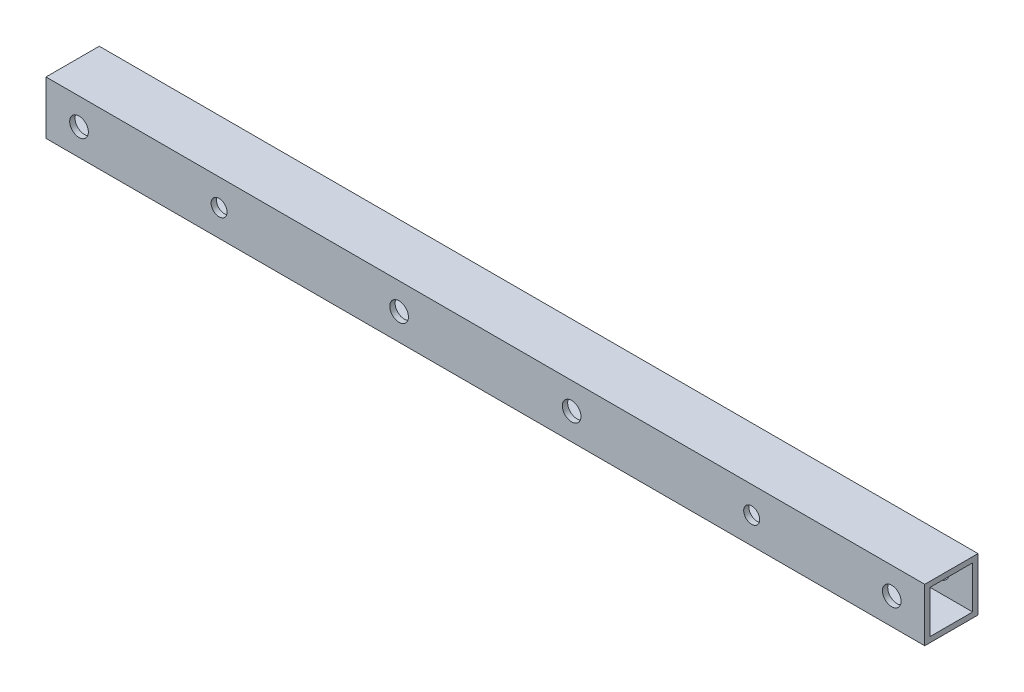
ISO-10303-21;
HEADER;
FILE_DESCRIPTION(('STEP AP214'),'2;1');
FILE_NAME('part.step','',(''),(''),'','','');
FILE_SCHEMA(('AUTOMOTIVE_DESIGN { 1 0 10303 214 1 1 1 1 }'));
ENDSEC;
DATA;
#1=APPLICATION_CONTEXT('core data for automotive mechanical design processes');
#2=APPLICATION_PROTOCOL_DEFINITION('international standard','automotive_design',2000,#1);
#3=PRODUCT_CONTEXT('',#1,'mechanical');
#4=PRODUCT('Part','Part','',(#3));
#5=PRODUCT_RELATED_PRODUCT_CATEGORY('part','',(#4));
#6=PRODUCT_DEFINITION_FORMATION('','',#4);
#7=PRODUCT_DEFINITION_CONTEXT('part definition',#1,'design');
#8=PRODUCT_DEFINITION('design','',#6,#7);
#9=PRODUCT_DEFINITION_SHAPE('','',#8);
#10=(LENGTH_UNIT() NAMED_UNIT(*) SI_UNIT(.MILLI.,.METRE.));
#11=(NAMED_UNIT(*) PLANE_ANGLE_UNIT() SI_UNIT($,.RADIAN.));
#12=(NAMED_UNIT(*) SI_UNIT($,.STERADIAN.) SOLID_ANGLE_UNIT());
#13=UNCERTAINTY_MEASURE_WITH_UNIT(LENGTH_MEASURE(1.E-05),#10,'distance_accuracy_value','');
#14=(GEOMETRIC_REPRESENTATION_CONTEXT(3) GLOBAL_UNCERTAINTY_ASSIGNED_CONTEXT((#13)) GLOBAL_UNIT_ASSIGNED_CONTEXT((#10,
#11,#12)) REPRESENTATION_CONTEXT('',''));
#15=CARTESIAN_POINT('',(0.,0.,0.));
#16=DIRECTION('',(0.,0.,1.));
#17=DIRECTION('',(1.,0.,0.));
#18=AXIS2_PLACEMENT_3D('',#15,#16,#17);
#19=CARTESIAN_POINT('',(-165.,-5.,-5.));
#20=DIRECTION('',(0.,0.,-1.));
#21=DIRECTION('',(-1.,0.,0.));
#22=AXIS2_PLACEMENT_3D('',#19,#20,#21);
#23=PLANE('',#22);
#24=CARTESIAN_POINT('',(-132.5,0.,-5.));
#25=DIRECTION('',(0.,0.,1.));
#26=DIRECTION('',(-1.,0.,0.));
#27=AXIS2_PLACEMENT_3D('',#24,#25,#26);
#28=CIRCLE('',#27,1.5);
#29=CARTESIAN_POINT('',(-134.,0.,-5.));
#30=VERTEX_POINT('',#29);
#31=EDGE_CURVE('E247',#30,#30,#28,.T.);
#32=ORIENTED_EDGE('',*,*,#31,.T.);
#33=EDGE_LOOP('',(#32));
#34=FACE_BOUND('',#33,.T.);
#35=CARTESIAN_POINT('',(-32.5,0.,-5.));
#36=DIRECTION('',(0.,0.,1.));
#37=DIRECTION('',(1.,0.,0.));
#38=AXIS2_PLACEMENT_3D('',#35,#36,#37);
#39=CIRCLE('',#38,1.5);
#40=CARTESIAN_POINT('',(-31.,0.,-5.));
#41=VERTEX_POINT('',#40);
#42=EDGE_CURVE('E254',#41,#41,#39,.T.);
#43=ORIENTED_EDGE('',*,*,#42,.T.);
#44=EDGE_LOOP('',(#43));
#45=FACE_BOUND('',#44,.T.);
#46=CARTESIAN_POINT('',(-158.8,0.,-5.));
#47=DIRECTION('',(0.,0.,1.));
#48=DIRECTION('',(-1.,0.,0.));
#49=AXIS2_PLACEMENT_3D('',#46,#47,#48);
#50=CIRCLE('',#49,1.75000000000001);
#51=CARTESIAN_POINT('',(-160.55,0.,-5.));
#52=VERTEX_POINT('',#51);
#53=EDGE_CURVE('E235',#52,#52,#50,.T.);
#54=ORIENTED_EDGE('',*,*,#53,.T.);
#55=EDGE_LOOP('',(#54));
#56=FACE_BOUND('',#55,.T.);
#57=CARTESIAN_POINT('',(-6.20000000000001,0.,-5.));
#58=DIRECTION('',(0.,0.,1.));
#59=DIRECTION('',(1.,0.,0.));
#60=AXIS2_PLACEMENT_3D('',#57,#58,#59);
#61=CIRCLE('',#60,1.75);
#62=CARTESIAN_POINT('',(-4.45000000000001,0.,-5.));
#63=VERTEX_POINT('',#62);
#64=EDGE_CURVE('E242',#63,#63,#61,.T.);
#65=ORIENTED_EDGE('',*,*,#64,.T.);
#66=EDGE_LOOP('',(#65));
#67=FACE_BOUND('',#66,.T.);
#68=CARTESIAN_POINT('',(-98.7,0.,-5.));
#69=DIRECTION('',(0.,0.,1.));
#70=DIRECTION('',(-1.,0.,0.));
#71=AXIS2_PLACEMENT_3D('',#68,#69,#70);
#72=CIRCLE('',#71,1.75);
#73=CARTESIAN_POINT('',(-100.45,0.,-5.));
#74=VERTEX_POINT('',#73);
#75=EDGE_CURVE('E259',#74,#74,#72,.T.);
#76=ORIENTED_EDGE('',*,*,#75,.T.);
#77=EDGE_LOOP('',(#76));
#78=FACE_BOUND('',#77,.T.);
#79=CARTESIAN_POINT('',(-66.3,0.,-5.));
#80=DIRECTION('',(0.,0.,1.));
#81=DIRECTION('',(1.,0.,0.));
#82=AXIS2_PLACEMENT_3D('',#79,#80,#81);
#83=CIRCLE('',#82,1.75);
#84=CARTESIAN_POINT('',(-64.55,0.,-5.));
#85=VERTEX_POINT('',#84);
#86=EDGE_CURVE('E200',#85,#85,#83,.T.);
#87=ORIENTED_EDGE('',*,*,#86,.T.);
#88=EDGE_LOOP('',(#87));
#89=FACE_BOUND('',#88,.T.);
#90=DIRECTION('',(0.,1.,0.));
#91=VECTOR('',#90,1.);
#92=CARTESIAN_POINT('',(0.,-5.,-5.));
#93=LINE('',#92,#91);
#94=CARTESIAN_POINT('',(0.,-5.,-5.));
#95=VERTEX_POINT('',#94);
#96=CARTESIAN_POINT('',(0.,5.,-5.));
#97=VERTEX_POINT('',#96);
#98=EDGE_CURVE('E164',#95,#97,#93,.T.);
#99=ORIENTED_EDGE('',*,*,#98,.F.);
#100=DIRECTION('',(1.,0.,0.));
#101=VECTOR('',#100,1.);
#102=CARTESIAN_POINT('',(-165.,-5.,-5.));
#103=LINE('',#102,#101);
#104=CARTESIAN_POINT('',(-165.,-5.,-5.));
#105=VERTEX_POINT('',#104);
#106=EDGE_CURVE('E12',#105,#95,#103,.T.);
#107=ORIENTED_EDGE('',*,*,#106,.F.);
#108=DIRECTION('',(0.,1.,0.));
#109=VECTOR('',#108,1.);
#110=CARTESIAN_POINT('',(-165.,-5.,-5.));
#111=LINE('',#110,#109);
#112=CARTESIAN_POINT('',(-165.,5.,-5.));
#113=VERTEX_POINT('',#112);
#114=EDGE_CURVE('E168',#105,#113,#111,.T.);
#115=ORIENTED_EDGE('',*,*,#114,.T.);
#116=DIRECTION('',(1.,0.,0.));
#117=VECTOR('',#116,1.);
#118=CARTESIAN_POINT('',(-165.,5.,-5.));
#119=LINE('',#118,#117);
#120=EDGE_CURVE('E181',#113,#97,#119,.T.);
#121=ORIENTED_EDGE('',*,*,#120,.T.);
#122=EDGE_LOOP('',(#99,#107,#115,#121));
#123=FACE_BOUND('',#122,.T.);
#124=ADVANCED_FACE('F63',(#34,#45,#56,#67,#78,#89,#123),#23,.T.);
#125=CARTESIAN_POINT('',(-165.,-5.,5.));
#126=DIRECTION('',(0.,-1.,0.));
#127=DIRECTION('',(0.,0.,-1.));
#128=AXIS2_PLACEMENT_3D('',#125,#126,#127);
#129=PLANE('',#128);
#130=DIRECTION('',(0.,0.,-1.));
#131=VECTOR('',#130,1.);
#132=CARTESIAN_POINT('',(0.,-5.,5.));
#133=LINE('',#132,#131);
#134=CARTESIAN_POINT('',(0.,-5.,5.));
#135=VERTEX_POINT('',#134);
#136=EDGE_CURVE('E172',#135,#95,#133,.T.);
#137=ORIENTED_EDGE('',*,*,#136,.F.);
#138=DIRECTION('',(1.,0.,0.));
#139=VECTOR('',#138,1.);
#140=CARTESIAN_POINT('',(-165.,-5.,5.));
#141=LINE('',#140,#139);
#142=CARTESIAN_POINT('',(-165.,-5.,5.));
#143=VERTEX_POINT('',#142);
#144=EDGE_CURVE('E71',#143,#135,#141,.T.);
#145=ORIENTED_EDGE('',*,*,#144,.F.);
#146=DIRECTION('',(0.,0.,-1.));
#147=VECTOR('',#146,1.);
#148=CARTESIAN_POINT('',(-165.,-5.,5.));
#149=LINE('',#148,#147);
#150=EDGE_CURVE('E178',#143,#105,#149,.T.);
#151=ORIENTED_EDGE('',*,*,#150,.T.);
#152=ORIENTED_EDGE('',*,*,#106,.T.);
#153=EDGE_LOOP('',(#137,#145,#151,#152));
#154=FACE_BOUND('',#153,.T.);
#155=ADVANCED_FACE('F272',(#154),#129,.T.);
#156=CARTESIAN_POINT('',(-165.,-5.,5.));
#157=DIRECTION('',(0.,0.,1.));
#158=DIRECTION('',(1.,0.,0.));
#159=AXIS2_PLACEMENT_3D('',#156,#157,#158);
#160=PLANE('',#159);
#161=CARTESIAN_POINT('',(-132.5,0.,5.));
#162=DIRECTION('',(0.,0.,1.));
#163=DIRECTION('',(-1.,0.,0.));
#164=AXIS2_PLACEMENT_3D('',#161,#162,#163);
#165=CIRCLE('',#164,1.5);
#166=CARTESIAN_POINT('',(-134.,0.,5.));
#167=VERTEX_POINT('',#166);
#168=EDGE_CURVE('E250',#167,#167,#165,.T.);
#169=ORIENTED_EDGE('',*,*,#168,.F.);
#170=EDGE_LOOP('',(#169));
#171=FACE_BOUND('',#170,.T.);
#172=CARTESIAN_POINT('',(-32.5,0.,5.));
#173=DIRECTION('',(0.,0.,1.));
#174=DIRECTION('',(1.,0.,0.));
#175=AXIS2_PLACEMENT_3D('',#172,#173,#174);
#176=CIRCLE('',#175,1.5);
#177=CARTESIAN_POINT('',(-31.,0.,5.));
#178=VERTEX_POINT('',#177);
#179=EDGE_CURVE('E239',#178,#178,#176,.T.);
#180=ORIENTED_EDGE('',*,*,#179,.F.);
#181=EDGE_LOOP('',(#180));
#182=FACE_BOUND('',#181,.T.);
#183=CARTESIAN_POINT('',(-158.8,0.,5.));
#184=DIRECTION('',(0.,0.,1.));
#185=DIRECTION('',(-1.,0.,0.));
#186=AXIS2_PLACEMENT_3D('',#183,#184,#185);
#187=CIRCLE('',#186,1.75000000000001);
#188=CARTESIAN_POINT('',(-160.55,0.,5.));
#189=VERTEX_POINT('',#188);
#190=EDGE_CURVE('E238',#189,#189,#187,.T.);
#191=ORIENTED_EDGE('',*,*,#190,.F.);
#192=EDGE_LOOP('',(#191));
#193=FACE_BOUND('',#192,.T.);
#194=CARTESIAN_POINT('',(-6.20000000000001,0.,5.));
#195=DIRECTION('',(0.,0.,1.));
#196=DIRECTION('',(1.,0.,0.));
#197=AXIS2_PLACEMENT_3D('',#194,#195,#196);
#198=CIRCLE('',#197,1.75);
#199=CARTESIAN_POINT('',(-4.45000000000001,0.,5.));
#200=VERTEX_POINT('',#199);
#201=EDGE_CURVE('E232',#200,#200,#198,.T.);
#202=ORIENTED_EDGE('',*,*,#201,.F.);
#203=EDGE_LOOP('',(#202));
#204=FACE_BOUND('',#203,.T.);
#205=CARTESIAN_POINT('',(-98.7,0.,5.));
#206=DIRECTION('',(0.,0.,1.));
#207=DIRECTION('',(-1.,0.,0.));
#208=AXIS2_PLACEMENT_3D('',#205,#206,#207);
#209=CIRCLE('',#208,1.75);
#210=CARTESIAN_POINT('',(-100.45,0.,5.));
#211=VERTEX_POINT('',#210);
#212=EDGE_CURVE('E251',#211,#211,#209,.T.);
#213=ORIENTED_EDGE('',*,*,#212,.F.);
#214=EDGE_LOOP('',(#213));
#215=FACE_BOUND('',#214,.T.);
#216=CARTESIAN_POINT('',(-66.3,0.,5.));
#217=DIRECTION('',(0.,0.,1.));
#218=DIRECTION('',(1.,0.,0.));
#219=AXIS2_PLACEMENT_3D('',#216,#217,#218);
#220=CIRCLE('',#219,1.75);
#221=CARTESIAN_POINT('',(-64.55,0.,5.));
#222=VERTEX_POINT('',#221);
#223=EDGE_CURVE('E229',#222,#222,#220,.T.);
#224=ORIENTED_EDGE('',*,*,#223,.F.);
#225=EDGE_LOOP('',(#224));
#226=FACE_BOUND('',#225,.T.);
#227=DIRECTION('',(0.,-1.,0.));
#228=VECTOR('',#227,1.);
#229=CARTESIAN_POINT('',(0.,-5.,5.));
#230=LINE('',#229,#228);
#231=CARTESIAN_POINT('',(0.,5.,5.));
#232=VERTEX_POINT('',#231);
#233=EDGE_CURVE('E187',#232,#135,#230,.T.);
#234=ORIENTED_EDGE('',*,*,#233,.F.);
#235=DIRECTION('',(1.,0.,0.));
#236=VECTOR('',#235,1.);
#237=CARTESIAN_POINT('',(-165.,5.,5.));
#238=LINE('',#237,#236);
#239=CARTESIAN_POINT('',(-165.,5.,5.));
#240=VERTEX_POINT('',#239);
#241=EDGE_CURVE('E193',#240,#232,#238,.T.);
#242=ORIENTED_EDGE('',*,*,#241,.F.);
#243=DIRECTION('',(0.,-1.,0.));
#244=VECTOR('',#243,1.);
#245=CARTESIAN_POINT('',(-165.,-5.,5.));
#246=LINE('',#245,#244);
#247=EDGE_CURVE('E175',#240,#143,#246,.T.);
#248=ORIENTED_EDGE('',*,*,#247,.T.);
#249=ORIENTED_EDGE('',*,*,#144,.T.);
#250=EDGE_LOOP('',(#234,#242,#248,#249));
#251=FACE_BOUND('',#250,.T.);
#252=ADVANCED_FACE('F268',(#171,#182,#193,#204,#215,#226,#251),#160,.T.);
#253=CARTESIAN_POINT('',(-165.,5.,5.));
#254=DIRECTION('',(0.,1.,0.));
#255=DIRECTION('',(0.,0.,1.));
#256=AXIS2_PLACEMENT_3D('',#253,#254,#255);
#257=PLANE('',#256);
#258=DIRECTION('',(0.,0.,1.));
#259=VECTOR('',#258,1.);
#260=CARTESIAN_POINT('',(0.,5.,5.));
#261=LINE('',#260,#259);
#262=EDGE_CURVE('E184',#97,#232,#261,.T.);
#263=ORIENTED_EDGE('',*,*,#262,.F.);
#264=ORIENTED_EDGE('',*,*,#120,.F.);
#265=DIRECTION('',(0.,0.,1.));
#266=VECTOR('',#265,1.);
#267=CARTESIAN_POINT('',(-165.,5.,5.));
#268=LINE('',#267,#266);
#269=EDGE_CURVE('E171',#113,#240,#268,.T.);
#270=ORIENTED_EDGE('',*,*,#269,.T.);
#271=ORIENTED_EDGE('',*,*,#241,.T.);
#272=EDGE_LOOP('',(#263,#264,#270,#271));
#273=FACE_BOUND('',#272,.T.);
#274=ADVANCED_FACE('F271',(#273),#257,.T.);
#275=CARTESIAN_POINT('',(-165.,0.,0.));
#276=DIRECTION('',(1.,0.,0.));
#277=DIRECTION('',(0.,0.,-1.));
#278=AXIS2_PLACEMENT_3D('',#275,#276,#277);
#279=PLANE('',#278);
#280=DIRECTION('',(0.,0.,-1.));
#281=VECTOR('',#280,1.);
#282=CARTESIAN_POINT('',(-165.,-4.,0.));
#283=LINE('',#282,#281);
#284=CARTESIAN_POINT('',(-165.,-4.,4.));
#285=VERTEX_POINT('',#284);
#286=CARTESIAN_POINT('',(-165.,-4.,-4.));
#287=VERTEX_POINT('',#286);
#288=EDGE_CURVE('E136',#285,#287,#283,.T.);
#289=ORIENTED_EDGE('',*,*,#288,.T.);
#290=DIRECTION('',(0.,1.,0.));
#291=VECTOR('',#290,1.);
#292=CARTESIAN_POINT('',(-165.,0.,-4.));
#293=LINE('',#292,#291);
#294=CARTESIAN_POINT('',(-165.,4.,-4.));
#295=VERTEX_POINT('',#294);
#296=EDGE_CURVE('E130',#287,#295,#293,.T.);
#297=ORIENTED_EDGE('',*,*,#296,.T.);
#298=DIRECTION('',(0.,0.,1.));
#299=VECTOR('',#298,1.);
#300=CARTESIAN_POINT('',(-165.,4.,0.));
#301=LINE('',#300,#299);
#302=CARTESIAN_POINT('',(-165.,4.,4.));
#303=VERTEX_POINT('',#302);
#304=EDGE_CURVE('E139',#295,#303,#301,.T.);
#305=ORIENTED_EDGE('',*,*,#304,.T.);
#306=DIRECTION('',(0.,-1.,0.));
#307=VECTOR('',#306,1.);
#308=CARTESIAN_POINT('',(-165.,0.,4.));
#309=LINE('',#308,#307);
#310=EDGE_CURVE('E79',#303,#285,#309,.T.);
#311=ORIENTED_EDGE('',*,*,#310,.T.);
#312=EDGE_LOOP('',(#289,#297,#305,#311));
#313=FACE_BOUND('',#312,.T.);
#314=ORIENTED_EDGE('',*,*,#114,.F.);
#315=ORIENTED_EDGE('',*,*,#150,.F.);
#316=ORIENTED_EDGE('',*,*,#247,.F.);
#317=ORIENTED_EDGE('',*,*,#269,.F.);
#318=EDGE_LOOP('',(#314,#315,#316,#317));
#319=FACE_BOUND('',#318,.T.);
#320=ADVANCED_FACE('F143',(#313,#319),#279,.F.);
#321=CARTESIAN_POINT('',(0.,0.,0.));
#322=DIRECTION('',(1.,0.,0.));
#323=DIRECTION('',(0.,0.,-1.));
#324=AXIS2_PLACEMENT_3D('',#321,#322,#323);
#325=PLANE('',#324);
#326=DIRECTION('',(0.,1.,0.));
#327=VECTOR('',#326,1.);
#328=CARTESIAN_POINT('',(0.,0.,-4.));
#329=LINE('',#328,#327);
#330=CARTESIAN_POINT('',(0.,-4.,-4.));
#331=VERTEX_POINT('',#330);
#332=CARTESIAN_POINT('',(0.,4.,-4.));
#333=VERTEX_POINT('',#332);
#334=EDGE_CURVE('E87',#331,#333,#329,.T.);
#335=ORIENTED_EDGE('',*,*,#334,.F.);
#336=DIRECTION('',(0.,0.,-1.));
#337=VECTOR('',#336,1.);
#338=CARTESIAN_POINT('',(0.,-4.,0.));
#339=LINE('',#338,#337);
#340=CARTESIAN_POINT('',(0.,-4.,4.));
#341=VERTEX_POINT('',#340);
#342=EDGE_CURVE('E146',#341,#331,#339,.T.);
#343=ORIENTED_EDGE('',*,*,#342,.F.);
#344=DIRECTION('',(0.,-1.,0.));
#345=VECTOR('',#344,1.);
#346=CARTESIAN_POINT('',(0.,0.,4.));
#347=LINE('',#346,#345);
#348=CARTESIAN_POINT('',(0.,4.,4.));
#349=VERTEX_POINT('',#348);
#350=EDGE_CURVE('E149',#349,#341,#347,.T.);
#351=ORIENTED_EDGE('',*,*,#350,.F.);
#352=DIRECTION('',(0.,0.,1.));
#353=VECTOR('',#352,1.);
#354=CARTESIAN_POINT('',(0.,4.,0.));
#355=LINE('',#354,#353);
#356=EDGE_CURVE('E158',#333,#349,#355,.T.);
#357=ORIENTED_EDGE('',*,*,#356,.F.);
#358=EDGE_LOOP('',(#335,#343,#351,#357));
#359=FACE_BOUND('',#358,.T.);
#360=ORIENTED_EDGE('',*,*,#98,.T.);
#361=ORIENTED_EDGE('',*,*,#262,.T.);
#362=ORIENTED_EDGE('',*,*,#233,.T.);
#363=ORIENTED_EDGE('',*,*,#136,.T.);
#364=EDGE_LOOP('',(#360,#361,#362,#363));
#365=FACE_BOUND('',#364,.T.);
#366=ADVANCED_FACE('F282',(#359,#365),#325,.T.);
#367=CARTESIAN_POINT('',(-165.,0.,-4.));
#368=DIRECTION('',(0.,0.,-1.));
#369=DIRECTION('',(-1.,0.,0.));
#370=AXIS2_PLACEMENT_3D('',#367,#368,#369);
#371=PLANE('',#370);
#372=CARTESIAN_POINT('',(-132.5,0.,-4.));
#373=DIRECTION('',(0.,0.,-1.));
#374=DIRECTION('',(-1.,0.,0.));
#375=AXIS2_PLACEMENT_3D('',#372,#373,#374);
#376=CIRCLE('',#375,1.5);
#377=CARTESIAN_POINT('',(-134.,0.,-4.));
#378=VERTEX_POINT('',#377);
#379=EDGE_CURVE('E152',#378,#378,#376,.T.);
#380=ORIENTED_EDGE('',*,*,#379,.T.);
#381=EDGE_LOOP('',(#380));
#382=FACE_BOUND('',#381,.T.);
#383=CARTESIAN_POINT('',(-32.5,0.,-4.));
#384=DIRECTION('',(0.,0.,-1.));
#385=DIRECTION('',(-1.,0.,0.));
#386=AXIS2_PLACEMENT_3D('',#383,#384,#385);
#387=CIRCLE('',#386,1.5);
#388=CARTESIAN_POINT('',(-34.,0.,-4.));
#389=VERTEX_POINT('',#388);
#390=EDGE_CURVE('E214',#389,#389,#387,.T.);
#391=ORIENTED_EDGE('',*,*,#390,.T.);
#392=EDGE_LOOP('',(#391));
#393=FACE_BOUND('',#392,.T.);
#394=CARTESIAN_POINT('',(-158.8,0.,-4.));
#395=DIRECTION('',(0.,0.,-1.));
#396=DIRECTION('',(-1.,0.,0.));
#397=AXIS2_PLACEMENT_3D('',#394,#395,#396);
#398=CIRCLE('',#397,1.75000000000001);
#399=CARTESIAN_POINT('',(-160.55,0.,-4.));
#400=VERTEX_POINT('',#399);
#401=EDGE_CURVE('E211',#400,#400,#398,.T.);
#402=ORIENTED_EDGE('',*,*,#401,.T.);
#403=EDGE_LOOP('',(#402));
#404=FACE_BOUND('',#403,.T.);
#405=CARTESIAN_POINT('',(-6.20000000000001,0.,-4.));
#406=DIRECTION('',(0.,0.,-1.));
#407=DIRECTION('',(-1.,0.,0.));
#408=AXIS2_PLACEMENT_3D('',#405,#406,#407);
#409=CIRCLE('',#408,1.75);
#410=CARTESIAN_POINT('',(-7.95000000000001,0.,-4.));
#411=VERTEX_POINT('',#410);
#412=EDGE_CURVE('E208',#411,#411,#409,.T.);
#413=ORIENTED_EDGE('',*,*,#412,.T.);
#414=EDGE_LOOP('',(#413));
#415=FACE_BOUND('',#414,.T.);
#416=CARTESIAN_POINT('',(-98.7,0.,-4.));
#417=DIRECTION('',(0.,0.,-1.));
#418=DIRECTION('',(-1.,0.,0.));
#419=AXIS2_PLACEMENT_3D('',#416,#417,#418);
#420=CIRCLE('',#419,1.75);
#421=CARTESIAN_POINT('',(-100.45,0.,-4.));
#422=VERTEX_POINT('',#421);
#423=EDGE_CURVE('E204',#422,#422,#420,.T.);
#424=ORIENTED_EDGE('',*,*,#423,.T.);
#425=EDGE_LOOP('',(#424));
#426=FACE_BOUND('',#425,.T.);
#427=CARTESIAN_POINT('',(-66.3,0.,-4.));
#428=DIRECTION('',(0.,0.,-1.));
#429=DIRECTION('',(-1.,0.,0.));
#430=AXIS2_PLACEMENT_3D('',#427,#428,#429);
#431=CIRCLE('',#430,1.75);
#432=CARTESIAN_POINT('',(-68.05,0.,-4.));
#433=VERTEX_POINT('',#432);
#434=EDGE_CURVE('E199',#433,#433,#431,.T.);
#435=ORIENTED_EDGE('',*,*,#434,.T.);
#436=EDGE_LOOP('',(#435));
#437=FACE_BOUND('',#436,.T.);
#438=ORIENTED_EDGE('',*,*,#334,.T.);
#439=DIRECTION('',(1.,0.,0.));
#440=VECTOR('',#439,1.);
#441=CARTESIAN_POINT('',(-165.,4.,-4.));
#442=LINE('',#441,#440);
#443=EDGE_CURVE('E126',#295,#333,#442,.T.);
#444=ORIENTED_EDGE('',*,*,#443,.F.);
#445=ORIENTED_EDGE('',*,*,#296,.F.);
#446=DIRECTION('',(1.,0.,0.));
#447=VECTOR('',#446,1.);
#448=CARTESIAN_POINT('',(-165.,-4.,-4.));
#449=LINE('',#448,#447);
#450=EDGE_CURVE('E162',#287,#331,#449,.T.);
#451=ORIENTED_EDGE('',*,*,#450,.T.);
#452=EDGE_LOOP('',(#438,#444,#445,#451));
#453=FACE_BOUND('',#452,.T.);
#454=ADVANCED_FACE('F128',(#382,#393,#404,#415,#426,#437,#453),#371,.F.);
#455=CARTESIAN_POINT('',(-165.,-4.,0.));
#456=DIRECTION('',(0.,-1.,0.));
#457=DIRECTION('',(0.,0.,-1.));
#458=AXIS2_PLACEMENT_3D('',#455,#456,#457);
#459=PLANE('',#458);
#460=ORIENTED_EDGE('',*,*,#342,.T.);
#461=ORIENTED_EDGE('',*,*,#450,.F.);
#462=ORIENTED_EDGE('',*,*,#288,.F.);
#463=DIRECTION('',(1.,0.,0.));
#464=VECTOR('',#463,1.);
#465=CARTESIAN_POINT('',(-165.,-4.,4.));
#466=LINE('',#465,#464);
#467=EDGE_CURVE('E165',#285,#341,#466,.T.);
#468=ORIENTED_EDGE('',*,*,#467,.T.);
#469=EDGE_LOOP('',(#460,#461,#462,#468));
#470=FACE_BOUND('',#469,.T.);
#471=ADVANCED_FACE('F309',(#470),#459,.F.);
#472=CARTESIAN_POINT('',(-165.,0.,4.));
#473=DIRECTION('',(0.,0.,1.));
#474=DIRECTION('',(1.,0.,0.));
#475=AXIS2_PLACEMENT_3D('',#472,#473,#474);
#476=PLANE('',#475);
#477=CARTESIAN_POINT('',(-132.5,0.,4.));
#478=DIRECTION('',(0.,0.,1.));
#479=DIRECTION('',(1.,0.,0.));
#480=AXIS2_PLACEMENT_3D('',#477,#478,#479);
#481=CIRCLE('',#480,1.5);
#482=CARTESIAN_POINT('',(-131.,0.,4.));
#483=VERTEX_POINT('',#482);
#484=EDGE_CURVE('E66',#483,#483,#481,.T.);
#485=ORIENTED_EDGE('',*,*,#484,.T.);
#486=EDGE_LOOP('',(#485));
#487=FACE_BOUND('',#486,.T.);
#488=CARTESIAN_POINT('',(-32.5,0.,4.));
#489=DIRECTION('',(0.,0.,1.));
#490=DIRECTION('',(1.,0.,0.));
#491=AXIS2_PLACEMENT_3D('',#488,#489,#490);
#492=CIRCLE('',#491,1.5);
#493=CARTESIAN_POINT('',(-31.,0.,4.));
#494=VERTEX_POINT('',#493);
#495=EDGE_CURVE('E212',#494,#494,#492,.T.);
#496=ORIENTED_EDGE('',*,*,#495,.T.);
#497=EDGE_LOOP('',(#496));
#498=FACE_BOUND('',#497,.T.);
#499=CARTESIAN_POINT('',(-158.8,0.,4.));
#500=DIRECTION('',(0.,0.,1.));
#501=DIRECTION('',(1.,0.,0.));
#502=AXIS2_PLACEMENT_3D('',#499,#500,#501);
#503=CIRCLE('',#502,1.75000000000001);
#504=CARTESIAN_POINT('',(-157.05,0.,4.));
#505=VERTEX_POINT('',#504);
#506=EDGE_CURVE('E209',#505,#505,#503,.T.);
#507=ORIENTED_EDGE('',*,*,#506,.T.);
#508=EDGE_LOOP('',(#507));
#509=FACE_BOUND('',#508,.T.);
#510=CARTESIAN_POINT('',(-6.20000000000001,0.,4.));
#511=DIRECTION('',(0.,0.,1.));
#512=DIRECTION('',(1.,0.,0.));
#513=AXIS2_PLACEMENT_3D('',#510,#511,#512);
#514=CIRCLE('',#513,1.75);
#515=CARTESIAN_POINT('',(-4.45000000000001,0.,4.));
#516=VERTEX_POINT('',#515);
#517=EDGE_CURVE('E205',#516,#516,#514,.T.);
#518=ORIENTED_EDGE('',*,*,#517,.T.);
#519=EDGE_LOOP('',(#518));
#520=FACE_BOUND('',#519,.T.);
#521=CARTESIAN_POINT('',(-98.7,0.,4.));
#522=DIRECTION('',(0.,0.,1.));
#523=DIRECTION('',(1.,0.,0.));
#524=AXIS2_PLACEMENT_3D('',#521,#522,#523);
#525=CIRCLE('',#524,1.75);
#526=CARTESIAN_POINT('',(-96.95,0.,4.));
#527=VERTEX_POINT('',#526);
#528=EDGE_CURVE('E201',#527,#527,#525,.T.);
#529=ORIENTED_EDGE('',*,*,#528,.T.);
#530=EDGE_LOOP('',(#529));
#531=FACE_BOUND('',#530,.T.);
#532=CARTESIAN_POINT('',(-66.3,0.,4.));
#533=DIRECTION('',(0.,0.,1.));
#534=DIRECTION('',(1.,0.,0.));
#535=AXIS2_PLACEMENT_3D('',#532,#533,#534);
#536=CIRCLE('',#535,1.75);
#537=CARTESIAN_POINT('',(-64.55,0.,4.));
#538=VERTEX_POINT('',#537);
#539=EDGE_CURVE('E196',#538,#538,#536,.T.);
#540=ORIENTED_EDGE('',*,*,#539,.T.);
#541=EDGE_LOOP('',(#540));
#542=FACE_BOUND('',#541,.T.);
#543=ORIENTED_EDGE('',*,*,#350,.T.);
#544=ORIENTED_EDGE('',*,*,#467,.F.);
#545=ORIENTED_EDGE('',*,*,#310,.F.);
#546=DIRECTION('',(1.,0.,0.));
#547=VECTOR('',#546,1.);
#548=CARTESIAN_POINT('',(-165.,4.,4.));
#549=LINE('',#548,#547);
#550=EDGE_CURVE('E135',#303,#349,#549,.T.);
#551=ORIENTED_EDGE('',*,*,#550,.T.);
#552=EDGE_LOOP('',(#543,#544,#545,#551));
#553=FACE_BOUND('',#552,.T.);
#554=ADVANCED_FACE('F314',(#487,#498,#509,#520,#531,#542,#553),#476,.F.);
#555=CARTESIAN_POINT('',(-165.,4.,0.));
#556=DIRECTION('',(0.,1.,0.));
#557=DIRECTION('',(0.,0.,1.));
#558=AXIS2_PLACEMENT_3D('',#555,#556,#557);
#559=PLANE('',#558);
#560=ORIENTED_EDGE('',*,*,#356,.T.);
#561=ORIENTED_EDGE('',*,*,#550,.F.);
#562=ORIENTED_EDGE('',*,*,#304,.F.);
#563=ORIENTED_EDGE('',*,*,#443,.T.);
#564=EDGE_LOOP('',(#560,#561,#562,#563));
#565=FACE_BOUND('',#564,.T.);
#566=ADVANCED_FACE('F140',(#565),#559,.F.);
#567=CARTESIAN_POINT('',(-66.3,0.,-5.));
#568=DIRECTION('',(0.,0.,1.));
#569=DIRECTION('',(1.,0.,0.));
#570=AXIS2_PLACEMENT_3D('',#567,#568,#569);
#571=CYLINDRICAL_SURFACE('',#570,1.75);
#572=ORIENTED_EDGE('',*,*,#223,.T.);
#573=EDGE_LOOP('',(#572));
#574=FACE_BOUND('',#573,.T.);
#575=ORIENTED_EDGE('',*,*,#539,.F.);
#576=EDGE_LOOP('',(#575));
#577=FACE_BOUND('',#576,.T.);
#578=ADVANCED_FACE('F313',(#574,#577),#571,.F.);
#579=CARTESIAN_POINT('',(-98.7,0.,-5.));
#580=DIRECTION('',(0.,0.,1.));
#581=DIRECTION('',(1.,0.,0.));
#582=AXIS2_PLACEMENT_3D('',#579,#580,#581);
#583=CYLINDRICAL_SURFACE('',#582,1.75);
#584=ORIENTED_EDGE('',*,*,#212,.T.);
#585=EDGE_LOOP('',(#584));
#586=FACE_BOUND('',#585,.T.);
#587=ORIENTED_EDGE('',*,*,#528,.F.);
#588=EDGE_LOOP('',(#587));
#589=FACE_BOUND('',#588,.T.);
#590=ADVANCED_FACE('F265',(#586,#589),#583,.F.);
#591=CARTESIAN_POINT('',(-6.20000000000001,0.,-5.));
#592=DIRECTION('',(0.,0.,1.));
#593=DIRECTION('',(1.,0.,0.));
#594=AXIS2_PLACEMENT_3D('',#591,#592,#593);
#595=CYLINDRICAL_SURFACE('',#594,1.75);
#596=ORIENTED_EDGE('',*,*,#201,.T.);
#597=EDGE_LOOP('',(#596));
#598=FACE_BOUND('',#597,.T.);
#599=ORIENTED_EDGE('',*,*,#517,.F.);
#600=EDGE_LOOP('',(#599));
#601=FACE_BOUND('',#600,.T.);
#602=ADVANCED_FACE('F337',(#598,#601),#595,.F.);
#603=CARTESIAN_POINT('',(-158.8,0.,-5.));
#604=DIRECTION('',(0.,0.,1.));
#605=DIRECTION('',(1.,0.,0.));
#606=AXIS2_PLACEMENT_3D('',#603,#604,#605);
#607=CYLINDRICAL_SURFACE('',#606,1.75000000000001);
#608=ORIENTED_EDGE('',*,*,#190,.T.);
#609=EDGE_LOOP('',(#608));
#610=FACE_BOUND('',#609,.T.);
#611=ORIENTED_EDGE('',*,*,#506,.F.);
#612=EDGE_LOOP('',(#611));
#613=FACE_BOUND('',#612,.T.);
#614=ADVANCED_FACE('F333',(#610,#613),#607,.F.);
#615=CARTESIAN_POINT('',(-32.5,0.,-5.));
#616=DIRECTION('',(0.,0.,1.));
#617=DIRECTION('',(1.,0.,0.));
#618=AXIS2_PLACEMENT_3D('',#615,#616,#617);
#619=CYLINDRICAL_SURFACE('',#618,1.5);
#620=ORIENTED_EDGE('',*,*,#179,.T.);
#621=EDGE_LOOP('',(#620));
#622=FACE_BOUND('',#621,.T.);
#623=ORIENTED_EDGE('',*,*,#495,.F.);
#624=EDGE_LOOP('',(#623));
#625=FACE_BOUND('',#624,.T.);
#626=ADVANCED_FACE('F345',(#622,#625),#619,.F.);
#627=CARTESIAN_POINT('',(-132.5,0.,-5.));
#628=DIRECTION('',(0.,0.,1.));
#629=DIRECTION('',(1.,0.,0.));
#630=AXIS2_PLACEMENT_3D('',#627,#628,#629);
#631=CYLINDRICAL_SURFACE('',#630,1.5);
#632=ORIENTED_EDGE('',*,*,#168,.T.);
#633=EDGE_LOOP('',(#632));
#634=FACE_BOUND('',#633,.T.);
#635=ORIENTED_EDGE('',*,*,#484,.F.);
#636=EDGE_LOOP('',(#635));
#637=FACE_BOUND('',#636,.T.);
#638=ADVANCED_FACE('F325',(#634,#637),#631,.F.);
#639=ORIENTED_EDGE('',*,*,#86,.F.);
#640=EDGE_LOOP('',(#639));
#641=FACE_BOUND('',#640,.T.);
#642=ORIENTED_EDGE('',*,*,#434,.F.);
#643=EDGE_LOOP('',(#642));
#644=FACE_BOUND('',#643,.T.);
#645=ADVANCED_FACE('F321',(#641,#644),#571,.F.);
#646=ORIENTED_EDGE('',*,*,#75,.F.);
#647=EDGE_LOOP('',(#646));
#648=FACE_BOUND('',#647,.T.);
#649=ORIENTED_EDGE('',*,*,#423,.F.);
#650=EDGE_LOOP('',(#649));
#651=FACE_BOUND('',#650,.T.);
#652=ADVANCED_FACE('F324',(#648,#651),#583,.F.);
#653=ORIENTED_EDGE('',*,*,#64,.F.);
#654=EDGE_LOOP('',(#653));
#655=FACE_BOUND('',#654,.T.);
#656=ORIENTED_EDGE('',*,*,#412,.F.);
#657=EDGE_LOOP('',(#656));
#658=FACE_BOUND('',#657,.T.);
#659=ADVANCED_FACE('F331',(#655,#658),#595,.F.);
#660=ORIENTED_EDGE('',*,*,#53,.F.);
#661=EDGE_LOOP('',(#660));
#662=FACE_BOUND('',#661,.T.);
#663=ORIENTED_EDGE('',*,*,#401,.F.);
#664=EDGE_LOOP('',(#663));
#665=FACE_BOUND('',#664,.T.);
#666=ADVANCED_FACE('F327',(#662,#665),#607,.F.);
#667=ORIENTED_EDGE('',*,*,#42,.F.);
#668=EDGE_LOOP('',(#667));
#669=FACE_BOUND('',#668,.T.);
#670=ORIENTED_EDGE('',*,*,#390,.F.);
#671=EDGE_LOOP('',(#670));
#672=FACE_BOUND('',#671,.T.);
#673=ADVANCED_FACE('F330',(#669,#672),#619,.F.);
#674=ORIENTED_EDGE('',*,*,#31,.F.);
#675=EDGE_LOOP('',(#674));
#676=FACE_BOUND('',#675,.T.);
#677=ORIENTED_EDGE('',*,*,#379,.F.);
#678=EDGE_LOOP('',(#677));
#679=FACE_BOUND('',#678,.T.);
#680=ADVANCED_FACE('F338',(#676,#679),#631,.F.);
#681=CLOSED_SHELL('',(#124,#155,#252,#274,#320,#366,#454,#471,#554,#566,#578,#590,#602,#614,
#626,#638,#645,#652,#659,#666,#673,#680));
#682=MANIFOLD_SOLID_BREP('B2',#681);
#683=ADVANCED_BREP_SHAPE_REPRESENTATION('',(#18,#682),#14);
#684=SHAPE_DEFINITION_REPRESENTATION(#9,#683);
ENDSEC;
END-ISO-10303-21;
